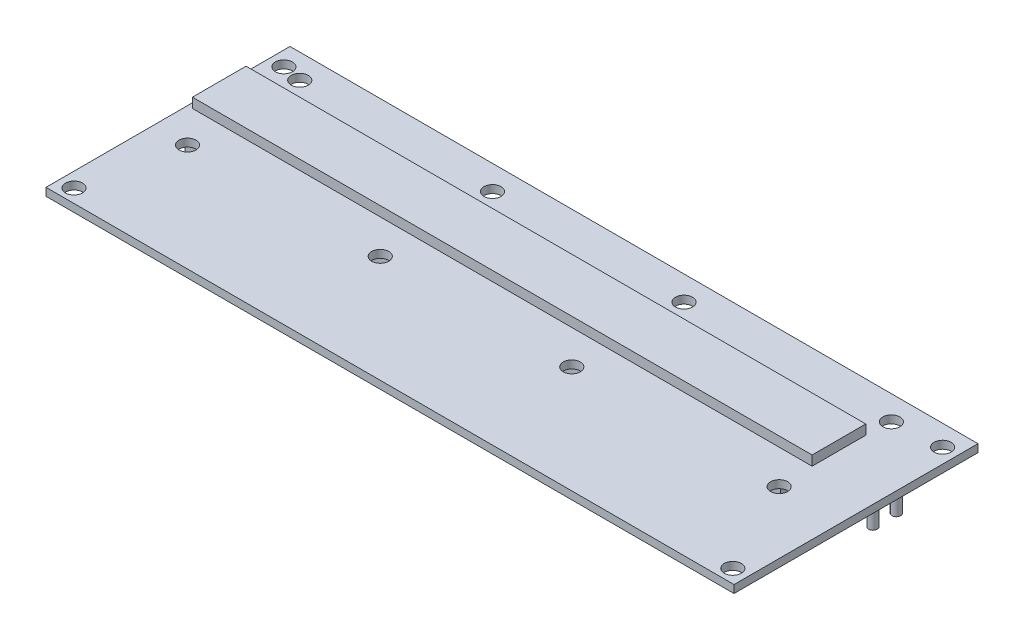
ISO-10303-21;
HEADER;
FILE_DESCRIPTION(('STEP AP214'),'2;1');
FILE_NAME('part.step','',(''),(''),'','','');
FILE_SCHEMA(('AUTOMOTIVE_DESIGN { 1 0 10303 214 1 1 1 1 }'));
ENDSEC;
DATA;
#1=APPLICATION_CONTEXT('core data for automotive mechanical design processes');
#2=APPLICATION_PROTOCOL_DEFINITION('international standard','automotive_design',2000,#1);
#3=PRODUCT_CONTEXT('',#1,'mechanical');
#4=PRODUCT('Part','Part','',(#3));
#5=PRODUCT_RELATED_PRODUCT_CATEGORY('part','',(#4));
#6=PRODUCT_DEFINITION_FORMATION('','',#4);
#7=PRODUCT_DEFINITION_CONTEXT('part definition',#1,'design');
#8=PRODUCT_DEFINITION('design','',#6,#7);
#9=PRODUCT_DEFINITION_SHAPE('','',#8);
#10=(LENGTH_UNIT() NAMED_UNIT(*) SI_UNIT(.MILLI.,.METRE.));
#11=(NAMED_UNIT(*) PLANE_ANGLE_UNIT() SI_UNIT($,.RADIAN.));
#12=(NAMED_UNIT(*) SI_UNIT($,.STERADIAN.) SOLID_ANGLE_UNIT());
#13=UNCERTAINTY_MEASURE_WITH_UNIT(LENGTH_MEASURE(1.E-05),#10,'distance_accuracy_value','');
#14=(GEOMETRIC_REPRESENTATION_CONTEXT(3) GLOBAL_UNCERTAINTY_ASSIGNED_CONTEXT((#13)) GLOBAL_UNIT_ASSIGNED_CONTEXT((#10,
#11,#12)) REPRESENTATION_CONTEXT('',''));
#15=CARTESIAN_POINT('',(0.,0.,0.));
#16=DIRECTION('',(0.,0.,1.));
#17=DIRECTION('',(1.,0.,0.));
#18=AXIS2_PLACEMENT_3D('',#15,#16,#17);
#19=CARTESIAN_POINT('',(-68.5,-11.,-11.5));
#20=DIRECTION('',(0.,0.,1.));
#21=DIRECTION('',(1.,0.,0.));
#22=AXIS2_PLACEMENT_3D('',#19,#20,#21);
#23=PLANE('',#22);
#24=DIRECTION('',(1.,0.,0.));
#25=VECTOR('',#24,1.);
#26=CARTESIAN_POINT('',(-68.5,-11.,-11.5));
#27=LINE('',#26,#25);
#28=CARTESIAN_POINT('',(-52.,-11.,-11.5));
#29=VERTEX_POINT('',#28);
#30=CARTESIAN_POINT('',(53.5,-11.,-11.5));
#31=VERTEX_POINT('',#30);
#32=EDGE_CURVE('E171',#29,#31,#27,.T.);
#33=ORIENTED_EDGE('',*,*,#32,.F.);
#34=DIRECTION('',(0.,-1.,0.));
#35=VECTOR('',#34,1.);
#36=CARTESIAN_POINT('',(-52.,11.9268604418766,-11.5));
#37=LINE('',#36,#35);
#38=CARTESIAN_POINT('',(-52.,0.,-11.5));
#39=VERTEX_POINT('',#38);
#40=EDGE_CURVE('E158',#39,#29,#37,.T.);
#41=ORIENTED_EDGE('',*,*,#40,.F.);
#42=DIRECTION('',(1.,0.,0.));
#43=VECTOR('',#42,1.);
#44=CARTESIAN_POINT('',(-68.5,0.,-11.5));
#45=LINE('',#44,#43);
#46=CARTESIAN_POINT('',(53.5,0.,-11.5));
#47=VERTEX_POINT('',#46);
#48=EDGE_CURVE('E169',#39,#47,#45,.T.);
#49=ORIENTED_EDGE('',*,*,#48,.T.);
#50=DIRECTION('',(0.,1.,0.));
#51=VECTOR('',#50,1.);
#52=CARTESIAN_POINT('',(53.5,-11.,-11.5));
#53=LINE('',#52,#51);
#54=EDGE_CURVE('E200',#31,#47,#53,.T.);
#55=ORIENTED_EDGE('',*,*,#54,.F.);
#56=EDGE_LOOP('',(#33,#41,#49,#55));
#57=FACE_BOUND('',#56,.T.);
#58=ADVANCED_FACE('F40',(#57),#23,.F.);
#59=CARTESIAN_POINT('',(-68.5,-11.,-1.5));
#60=DIRECTION('',(0.,0.,-1.));
#61=DIRECTION('',(-1.,0.,0.));
#62=AXIS2_PLACEMENT_3D('',#59,#60,#61);
#63=PLANE('',#62);
#64=DIRECTION('',(-1.,0.,0.));
#65=VECTOR('',#64,1.);
#66=CARTESIAN_POINT('',(-68.5,0.,-1.5));
#67=LINE('',#66,#65);
#68=CARTESIAN_POINT('',(53.5,0.,-1.5));
#69=VERTEX_POINT('',#68);
#70=CARTESIAN_POINT('',(-52.,0.,-1.5));
#71=VERTEX_POINT('',#70);
#72=EDGE_CURVE('E190',#69,#71,#67,.T.);
#73=ORIENTED_EDGE('',*,*,#72,.T.);
#74=DIRECTION('',(0.,-1.,0.));
#75=VECTOR('',#74,1.);
#76=CARTESIAN_POINT('',(-52.,11.9268604418766,-1.5));
#77=LINE('',#76,#75);
#78=CARTESIAN_POINT('',(-52.,-11.,-1.5));
#79=VERTEX_POINT('',#78);
#80=EDGE_CURVE('E161',#71,#79,#77,.T.);
#81=ORIENTED_EDGE('',*,*,#80,.T.);
#82=DIRECTION('',(-1.,0.,0.));
#83=VECTOR('',#82,1.);
#84=CARTESIAN_POINT('',(-68.5,-11.,-1.5));
#85=LINE('',#84,#83);
#86=CARTESIAN_POINT('',(53.5,-11.,-1.5));
#87=VERTEX_POINT('',#86);
#88=EDGE_CURVE('E197',#87,#79,#85,.T.);
#89=ORIENTED_EDGE('',*,*,#88,.F.);
#90=DIRECTION('',(0.,1.,0.));
#91=VECTOR('',#90,1.);
#92=CARTESIAN_POINT('',(53.5,-11.,-1.5));
#93=LINE('',#92,#91);
#94=EDGE_CURVE('E196',#87,#69,#93,.T.);
#95=ORIENTED_EDGE('',*,*,#94,.T.);
#96=EDGE_LOOP('',(#73,#81,#89,#95));
#97=FACE_BOUND('',#96,.T.);
#98=ADVANCED_FACE('F341',(#97),#63,.F.);
#99=CARTESIAN_POINT('',(0.,-11.,0.));
#100=DIRECTION('',(0.,-1.,0.));
#101=DIRECTION('',(0.,0.,-1.));
#102=AXIS2_PLACEMENT_3D('',#99,#100,#101);
#103=PLANE('',#102);
#104=DIRECTION('',(0.,0.,1.));
#105=VECTOR('',#104,1.);
#106=CARTESIAN_POINT('',(-52.,-11.,-1.5));
#107=LINE('',#106,#105);
#108=EDGE_CURVE('E172',#29,#79,#107,.T.);
#109=ORIENTED_EDGE('',*,*,#108,.F.);
#110=ORIENTED_EDGE('',*,*,#32,.T.);
#111=DIRECTION('',(0.,0.,1.));
#112=VECTOR('',#111,1.);
#113=CARTESIAN_POINT('',(53.5,-11.,-1.5));
#114=LINE('',#113,#112);
#115=EDGE_CURVE('E421',#31,#87,#114,.T.);
#116=ORIENTED_EDGE('',*,*,#115,.T.);
#117=ORIENTED_EDGE('',*,*,#88,.T.);
#118=EDGE_LOOP('',(#109,#110,#116,#117));
#119=FACE_BOUND('',#118,.T.);
#120=ADVANCED_FACE('F347',(#119),#103,.T.);
#121=CARTESIAN_POINT('',(0.,1.6,0.));
#122=DIRECTION('',(0.,1.,0.));
#123=DIRECTION('',(0.,0.,1.));
#124=AXIS2_PLACEMENT_3D('',#121,#122,#123);
#125=PLANE('',#124);
#126=CARTESIAN_POINT('',(15.25,1.6,3.));
#127=DIRECTION('',(0.,1.,0.));
#128=DIRECTION('',(0.,0.,-1.));
#129=AXIS2_PLACEMENT_3D('',#126,#127,#128);
#130=CIRCLE('',#129,1.75);
#131=CARTESIAN_POINT('',(15.25,1.6,1.25));
#132=VERTEX_POINT('',#131);
#133=EDGE_CURVE('E230',#132,#132,#130,.T.);
#134=ORIENTED_EDGE('',*,*,#133,.F.);
#135=EDGE_LOOP('',(#134));
#136=FACE_BOUND('',#135,.T.);
#137=CARTESIAN_POINT('',(-24.,1.6,3.));
#138=DIRECTION('',(0.,1.,0.));
#139=DIRECTION('',(0.,0.,1.));
#140=AXIS2_PLACEMENT_3D('',#137,#138,#139);
#141=CIRCLE('',#140,1.75);
#142=CARTESIAN_POINT('',(-24.,1.6,4.75));
#143=VERTEX_POINT('',#142);
#144=EDGE_CURVE('E233',#143,#143,#141,.T.);
#145=ORIENTED_EDGE('',*,*,#144,.F.);
#146=EDGE_LOOP('',(#145));
#147=FACE_BOUND('',#146,.T.);
#148=CARTESIAN_POINT('',(-63.5,1.6,3.));
#149=DIRECTION('',(0.,1.,0.));
#150=DIRECTION('',(0.,0.,1.));
#151=AXIS2_PLACEMENT_3D('',#148,#149,#150);
#152=CIRCLE('',#151,1.75);
#153=CARTESIAN_POINT('',(-63.5,1.6,4.75));
#154=VERTEX_POINT('',#153);
#155=EDGE_CURVE('E236',#154,#154,#152,.T.);
#156=ORIENTED_EDGE('',*,*,#155,.F.);
#157=EDGE_LOOP('',(#156));
#158=FACE_BOUND('',#157,.T.);
#159=CARTESIAN_POINT('',(-24.,1.6,-20.));
#160=DIRECTION('',(0.,1.,0.));
#161=DIRECTION('',(0.,0.,1.));
#162=AXIS2_PLACEMENT_3D('',#159,#160,#161);
#163=CIRCLE('',#162,1.75);
#164=CARTESIAN_POINT('',(-24.,1.6,-18.25));
#165=VERTEX_POINT('',#164);
#166=EDGE_CURVE('E239',#165,#165,#163,.T.);
#167=ORIENTED_EDGE('',*,*,#166,.F.);
#168=EDGE_LOOP('',(#167));
#169=FACE_BOUND('',#168,.T.);
#170=CARTESIAN_POINT('',(57.75,1.6,-20.));
#171=DIRECTION('',(0.,1.,0.));
#172=DIRECTION('',(0.,0.,-1.));
#173=AXIS2_PLACEMENT_3D('',#170,#171,#172);
#174=CIRCLE('',#173,1.75);
#175=CARTESIAN_POINT('',(57.75,1.6,-21.75));
#176=VERTEX_POINT('',#175);
#177=EDGE_CURVE('E221',#176,#176,#174,.T.);
#178=ORIENTED_EDGE('',*,*,#177,.F.);
#179=EDGE_LOOP('',(#178));
#180=FACE_BOUND('',#179,.T.);
#181=CARTESIAN_POINT('',(15.25,1.6,-20.));
#182=DIRECTION('',(0.,1.,0.));
#183=DIRECTION('',(0.,0.,-1.));
#184=AXIS2_PLACEMENT_3D('',#181,#182,#183);
#185=CIRCLE('',#184,1.75);
#186=CARTESIAN_POINT('',(15.25,1.6,-21.75));
#187=VERTEX_POINT('',#186);
#188=EDGE_CURVE('E226',#187,#187,#185,.T.);
#189=ORIENTED_EDGE('',*,*,#188,.F.);
#190=EDGE_LOOP('',(#189));
#191=FACE_BOUND('',#190,.T.);
#192=CARTESIAN_POINT('',(57.75,1.6,3.));
#193=DIRECTION('',(0.,1.,0.));
#194=DIRECTION('',(0.,0.,-1.));
#195=AXIS2_PLACEMENT_3D('',#192,#193,#194);
#196=CIRCLE('',#195,1.75);
#197=CARTESIAN_POINT('',(57.75,1.6,1.25));
#198=VERTEX_POINT('',#197);
#199=EDGE_CURVE('E227',#198,#198,#196,.T.);
#200=ORIENTED_EDGE('',*,*,#199,.F.);
#201=EDGE_LOOP('',(#200));
#202=FACE_BOUND('',#201,.T.);
#203=CARTESIAN_POINT('',(-63.5,1.6,-20.));
#204=DIRECTION('',(0.,1.,0.));
#205=DIRECTION('',(0.,0.,1.));
#206=AXIS2_PLACEMENT_3D('',#203,#204,#205);
#207=CIRCLE('',#206,1.75);
#208=CARTESIAN_POINT('',(-63.5,1.6,-18.25));
#209=VERTEX_POINT('',#208);
#210=EDGE_CURVE('E242',#209,#209,#207,.T.);
#211=ORIENTED_EDGE('',*,*,#210,.F.);
#212=EDGE_LOOP('',(#211));
#213=FACE_BOUND('',#212,.T.);
#214=CARTESIAN_POINT('',(67.5,1.6,22.25));
#215=DIRECTION('',(0.,1.,0.));
#216=DIRECTION('',(0.,0.,1.));
#217=AXIS2_PLACEMENT_3D('',#214,#215,#216);
#218=CIRCLE('',#217,1.75);
#219=CARTESIAN_POINT('',(67.5,1.6,24.));
#220=VERTEX_POINT('',#219);
#221=EDGE_CURVE('E255',#220,#220,#218,.T.);
#222=ORIENTED_EDGE('',*,*,#221,.F.);
#223=EDGE_LOOP('',(#222));
#224=FACE_BOUND('',#223,.T.);
#225=CARTESIAN_POINT('',(67.5,1.6,-20.75));
#226=DIRECTION('',(0.,1.,0.));
#227=DIRECTION('',(0.,0.,1.));
#228=AXIS2_PLACEMENT_3D('',#225,#226,#227);
#229=CIRCLE('',#228,1.75);
#230=CARTESIAN_POINT('',(67.5,1.6,-19.));
#231=VERTEX_POINT('',#230);
#232=EDGE_CURVE('E252',#231,#231,#229,.T.);
#233=ORIENTED_EDGE('',*,*,#232,.F.);
#234=EDGE_LOOP('',(#233));
#235=FACE_BOUND('',#234,.T.);
#236=CARTESIAN_POINT('',(-67.5,1.6,-20.75));
#237=DIRECTION('',(0.,1.,0.));
#238=DIRECTION('',(0.,0.,1.));
#239=AXIS2_PLACEMENT_3D('',#236,#237,#238);
#240=CIRCLE('',#239,1.75);
#241=CARTESIAN_POINT('',(-67.5,1.6,-19.));
#242=VERTEX_POINT('',#241);
#243=EDGE_CURVE('E248',#242,#242,#240,.T.);
#244=ORIENTED_EDGE('',*,*,#243,.F.);
#245=EDGE_LOOP('',(#244));
#246=FACE_BOUND('',#245,.T.);
#247=CARTESIAN_POINT('',(-67.5,1.6,22.25));
#248=DIRECTION('',(0.,1.,0.));
#249=DIRECTION('',(0.,0.,1.));
#250=AXIS2_PLACEMENT_3D('',#247,#248,#249);
#251=CIRCLE('',#250,1.75);
#252=CARTESIAN_POINT('',(-67.5,1.6,24.));
#253=VERTEX_POINT('',#252);
#254=EDGE_CURVE('E251',#253,#253,#251,.T.);
#255=ORIENTED_EDGE('',*,*,#254,.F.);
#256=EDGE_LOOP('',(#255));
#257=FACE_BOUND('',#256,.T.);
#258=DIRECTION('',(0.,0.,-1.));
#259=VECTOR('',#258,1.);
#260=CARTESIAN_POINT('',(70.5,1.6,-25.));
#261=LINE('',#260,#259);
#262=CARTESIAN_POINT('',(70.5,1.6,25.));
#263=VERTEX_POINT('',#262);
#264=CARTESIAN_POINT('',(70.5,1.6,-25.));
#265=VERTEX_POINT('',#264);
#266=EDGE_CURVE('E261',#263,#265,#261,.T.);
#267=ORIENTED_EDGE('',*,*,#266,.T.);
#268=DIRECTION('',(-1.,0.,0.));
#269=VECTOR('',#268,1.);
#270=CARTESIAN_POINT('',(-70.5,1.6,-25.));
#271=LINE('',#270,#269);
#272=CARTESIAN_POINT('',(-70.5,1.6,-25.));
#273=VERTEX_POINT('',#272);
#274=EDGE_CURVE('E264',#265,#273,#271,.T.);
#275=ORIENTED_EDGE('',*,*,#274,.T.);
#276=DIRECTION('',(0.,0.,1.));
#277=VECTOR('',#276,1.);
#278=CARTESIAN_POINT('',(-70.5,1.6,-25.));
#279=LINE('',#278,#277);
#280=CARTESIAN_POINT('',(-70.5,1.6,25.));
#281=VERTEX_POINT('',#280);
#282=EDGE_CURVE('E267',#273,#281,#279,.T.);
#283=ORIENTED_EDGE('',*,*,#282,.T.);
#284=DIRECTION('',(1.,0.,0.));
#285=VECTOR('',#284,1.);
#286=CARTESIAN_POINT('',(-70.5,1.6,25.));
#287=LINE('',#286,#285);
#288=EDGE_CURVE('E269',#281,#263,#287,.T.);
#289=ORIENTED_EDGE('',*,*,#288,.T.);
#290=EDGE_LOOP('',(#267,#275,#283,#289));
#291=FACE_BOUND('',#290,.T.);
#292=DIRECTION('',(1.,0.,0.));
#293=VECTOR('',#292,1.);
#294=CARTESIAN_POINT('',(-69.5,1.6,-4.));
#295=LINE('',#294,#293);
#296=CARTESIAN_POINT('',(-69.5,1.6,-4.));
#297=VERTEX_POINT('',#296);
#298=CARTESIAN_POINT('',(57.5,1.6,-4.));
#299=VERTEX_POINT('',#298);
#300=EDGE_CURVE('E405',#297,#299,#295,.T.);
#301=ORIENTED_EDGE('',*,*,#300,.F.);
#302=DIRECTION('',(0.,0.,1.));
#303=VECTOR('',#302,1.);
#304=CARTESIAN_POINT('',(-69.5,1.6,-15.));
#305=LINE('',#304,#303);
#306=CARTESIAN_POINT('',(-69.5,1.6,-15.));
#307=VERTEX_POINT('',#306);
#308=EDGE_CURVE('E389',#307,#297,#305,.T.);
#309=ORIENTED_EDGE('',*,*,#308,.F.);
#310=DIRECTION('',(-1.,0.,0.));
#311=VECTOR('',#310,1.);
#312=CARTESIAN_POINT('',(-69.5,1.6,-15.));
#313=LINE('',#312,#311);
#314=CARTESIAN_POINT('',(57.5,1.6,-15.));
#315=VERTEX_POINT('',#314);
#316=EDGE_CURVE('E396',#315,#307,#313,.T.);
#317=ORIENTED_EDGE('',*,*,#316,.F.);
#318=DIRECTION('',(0.,0.,-1.));
#319=VECTOR('',#318,1.);
#320=CARTESIAN_POINT('',(57.5,1.6,-15.));
#321=LINE('',#320,#319);
#322=EDGE_CURVE('E407',#299,#315,#321,.T.);
#323=ORIENTED_EDGE('',*,*,#322,.F.);
#324=EDGE_LOOP('',(#301,#309,#317,#323));
#325=FACE_BOUND('',#324,.T.);
#326=ADVANCED_FACE('F438',(#136,#147,#158,#169,#180,#191,#202,#213,#224,#235,#246,#257,#291,
#325),#125,.T.);
#327=CARTESIAN_POINT('',(0.,0.,0.));
#328=DIRECTION('',(0.,1.,0.));
#329=DIRECTION('',(0.,0.,1.));
#330=AXIS2_PLACEMENT_3D('',#327,#328,#329);
#331=PLANE('',#330);
#332=ORIENTED_EDGE('',*,*,#48,.F.);
#333=DIRECTION('',(0.,0.,1.));
#334=VECTOR('',#333,1.);
#335=CARTESIAN_POINT('',(-52.,0.,-1.5));
#336=LINE('',#335,#334);
#337=EDGE_CURVE('E155',#39,#71,#336,.T.);
#338=ORIENTED_EDGE('',*,*,#337,.T.);
#339=ORIENTED_EDGE('',*,*,#72,.F.);
#340=DIRECTION('',(0.,0.,1.));
#341=VECTOR('',#340,1.);
#342=CARTESIAN_POINT('',(53.5,0.,-1.5));
#343=LINE('',#342,#341);
#344=EDGE_CURVE('E177',#47,#69,#343,.T.);
#345=ORIENTED_EDGE('',*,*,#344,.F.);
#346=EDGE_LOOP('',(#332,#338,#339,#345));
#347=FACE_BOUND('',#346,.T.);
#348=CARTESIAN_POINT('',(67.8751781231778,0.,-6.09309738942425));
#349=DIRECTION('',(0.,1.,0.));
#350=DIRECTION('',(0.,0.,1.));
#351=AXIS2_PLACEMENT_3D('',#348,#349,#350);
#352=CIRCLE('',#351,0.888976414837918);
#353=CARTESIAN_POINT('',(67.8751781231778,0.,-5.20412097458633));
#354=VERTEX_POINT('',#353);
#355=EDGE_CURVE('E379',#354,#354,#352,.T.);
#356=ORIENTED_EDGE('',*,*,#355,.T.);
#357=EDGE_LOOP('',(#356));
#358=FACE_BOUND('',#357,.T.);
#359=CARTESIAN_POINT('',(67.8751781231778,0.,-10.8828976766984));
#360=DIRECTION('',(0.,1.,0.));
#361=DIRECTION('',(0.,0.,1.));
#362=AXIS2_PLACEMENT_3D('',#359,#360,#361);
#363=CIRCLE('',#362,0.888976414837918);
#364=CARTESIAN_POINT('',(67.8751781231778,0.,-9.99392126186049));
#365=VERTEX_POINT('',#364);
#366=EDGE_CURVE('E384',#365,#365,#363,.T.);
#367=ORIENTED_EDGE('',*,*,#366,.T.);
#368=EDGE_LOOP('',(#367));
#369=FACE_BOUND('',#368,.T.);
#370=DIRECTION('',(0.,0.,-1.));
#371=VECTOR('',#370,1.);
#372=CARTESIAN_POINT('',(70.5,0.,-25.));
#373=LINE('',#372,#371);
#374=CARTESIAN_POINT('',(70.5,0.,25.));
#375=VERTEX_POINT('',#374);
#376=CARTESIAN_POINT('',(70.5,0.,-25.));
#377=VERTEX_POINT('',#376);
#378=EDGE_CURVE('E272',#375,#377,#373,.T.);
#379=ORIENTED_EDGE('',*,*,#378,.F.);
#380=DIRECTION('',(1.,0.,0.));
#381=VECTOR('',#380,1.);
#382=CARTESIAN_POINT('',(-70.5,0.,25.));
#383=LINE('',#382,#381);
#384=CARTESIAN_POINT('',(-70.5,0.,25.));
#385=VERTEX_POINT('',#384);
#386=EDGE_CURVE('E265',#385,#375,#383,.T.);
#387=ORIENTED_EDGE('',*,*,#386,.F.);
#388=DIRECTION('',(0.,0.,1.));
#389=VECTOR('',#388,1.);
#390=CARTESIAN_POINT('',(-70.5,0.,-25.));
#391=LINE('',#390,#389);
#392=CARTESIAN_POINT('',(-70.5,0.,-25.));
#393=VERTEX_POINT('',#392);
#394=EDGE_CURVE('E278',#393,#385,#391,.T.);
#395=ORIENTED_EDGE('',*,*,#394,.F.);
#396=DIRECTION('',(-1.,0.,0.));
#397=VECTOR('',#396,1.);
#398=CARTESIAN_POINT('',(-70.5,0.,-25.));
#399=LINE('',#398,#397);
#400=EDGE_CURVE('E275',#377,#393,#399,.T.);
#401=ORIENTED_EDGE('',*,*,#400,.F.);
#402=EDGE_LOOP('',(#379,#387,#395,#401));
#403=FACE_BOUND('',#402,.T.);
#404=CARTESIAN_POINT('',(-67.5,0.,22.25));
#405=DIRECTION('',(0.,1.,0.));
#406=DIRECTION('',(0.,0.,1.));
#407=AXIS2_PLACEMENT_3D('',#404,#405,#406);
#408=CIRCLE('',#407,1.75);
#409=CARTESIAN_POINT('',(-67.5,0.,24.));
#410=VERTEX_POINT('',#409);
#411=EDGE_CURVE('E260',#410,#410,#408,.T.);
#412=ORIENTED_EDGE('',*,*,#411,.T.);
#413=EDGE_LOOP('',(#412));
#414=FACE_BOUND('',#413,.T.);
#415=CARTESIAN_POINT('',(-67.5,0.,-20.75));
#416=DIRECTION('',(0.,1.,0.));
#417=DIRECTION('',(0.,0.,1.));
#418=AXIS2_PLACEMENT_3D('',#415,#416,#417);
#419=CIRCLE('',#418,1.75);
#420=CARTESIAN_POINT('',(-67.5,0.,-19.));
#421=VERTEX_POINT('',#420);
#422=EDGE_CURVE('E290',#421,#421,#419,.T.);
#423=ORIENTED_EDGE('',*,*,#422,.T.);
#424=EDGE_LOOP('',(#423));
#425=FACE_BOUND('',#424,.T.);
#426=CARTESIAN_POINT('',(67.5,0.,-20.75));
#427=DIRECTION('',(0.,1.,0.));
#428=DIRECTION('',(0.,0.,1.));
#429=AXIS2_PLACEMENT_3D('',#426,#427,#428);
#430=CIRCLE('',#429,1.75);
#431=CARTESIAN_POINT('',(67.5,0.,-19.));
#432=VERTEX_POINT('',#431);
#433=EDGE_CURVE('E293',#432,#432,#430,.T.);
#434=ORIENTED_EDGE('',*,*,#433,.T.);
#435=EDGE_LOOP('',(#434));
#436=FACE_BOUND('',#435,.T.);
#437=CARTESIAN_POINT('',(67.5,0.,22.25));
#438=DIRECTION('',(0.,1.,0.));
#439=DIRECTION('',(0.,0.,1.));
#440=AXIS2_PLACEMENT_3D('',#437,#438,#439);
#441=CIRCLE('',#440,1.75);
#442=CARTESIAN_POINT('',(67.5,0.,24.));
#443=VERTEX_POINT('',#442);
#444=EDGE_CURVE('E276',#443,#443,#441,.T.);
#445=ORIENTED_EDGE('',*,*,#444,.T.);
#446=EDGE_LOOP('',(#445));
#447=FACE_BOUND('',#446,.T.);
#448=CARTESIAN_POINT('',(-63.5,0.,-20.));
#449=DIRECTION('',(0.,1.,0.));
#450=DIRECTION('',(0.,0.,1.));
#451=AXIS2_PLACEMENT_3D('',#448,#449,#450);
#452=CIRCLE('',#451,1.75);
#453=CARTESIAN_POINT('',(-63.5,0.,-18.25));
#454=VERTEX_POINT('',#453);
#455=EDGE_CURVE('E247',#454,#454,#452,.T.);
#456=ORIENTED_EDGE('',*,*,#455,.T.);
#457=EDGE_LOOP('',(#456));
#458=FACE_BOUND('',#457,.T.);
#459=CARTESIAN_POINT('',(57.75,0.,3.));
#460=DIRECTION('',(0.,1.,0.));
#461=DIRECTION('',(0.,0.,1.));
#462=AXIS2_PLACEMENT_3D('',#459,#460,#461);
#463=CIRCLE('',#462,1.75);
#464=CARTESIAN_POINT('',(57.75,0.,4.75));
#465=VERTEX_POINT('',#464);
#466=EDGE_CURVE('E300',#465,#465,#463,.T.);
#467=ORIENTED_EDGE('',*,*,#466,.T.);
#468=EDGE_LOOP('',(#467));
#469=FACE_BOUND('',#468,.T.);
#470=CARTESIAN_POINT('',(15.25,0.,-20.));
#471=DIRECTION('',(0.,1.,0.));
#472=DIRECTION('',(0.,0.,1.));
#473=AXIS2_PLACEMENT_3D('',#470,#471,#472);
#474=CIRCLE('',#473,1.75);
#475=CARTESIAN_POINT('',(15.25,0.,-18.25));
#476=VERTEX_POINT('',#475);
#477=EDGE_CURVE('E303',#476,#476,#474,.T.);
#478=ORIENTED_EDGE('',*,*,#477,.T.);
#479=EDGE_LOOP('',(#478));
#480=FACE_BOUND('',#479,.T.);
#481=CARTESIAN_POINT('',(57.75,0.,-20.));
#482=DIRECTION('',(0.,1.,0.));
#483=DIRECTION('',(0.,0.,1.));
#484=AXIS2_PLACEMENT_3D('',#481,#482,#483);
#485=CIRCLE('',#484,1.75);
#486=CARTESIAN_POINT('',(57.75,0.,-18.25));
#487=VERTEX_POINT('',#486);
#488=EDGE_CURVE('E306',#487,#487,#485,.T.);
#489=ORIENTED_EDGE('',*,*,#488,.T.);
#490=EDGE_LOOP('',(#489));
#491=FACE_BOUND('',#490,.T.);
#492=CARTESIAN_POINT('',(-24.,0.,-20.));
#493=DIRECTION('',(0.,1.,0.));
#494=DIRECTION('',(0.,0.,1.));
#495=AXIS2_PLACEMENT_3D('',#492,#493,#494);
#496=CIRCLE('',#495,1.75);
#497=CARTESIAN_POINT('',(-24.,0.,-18.25));
#498=VERTEX_POINT('',#497);
#499=EDGE_CURVE('E309',#498,#498,#496,.T.);
#500=ORIENTED_EDGE('',*,*,#499,.T.);
#501=EDGE_LOOP('',(#500));
#502=FACE_BOUND('',#501,.T.);
#503=CARTESIAN_POINT('',(-63.5,0.,3.));
#504=DIRECTION('',(0.,1.,0.));
#505=DIRECTION('',(0.,0.,1.));
#506=AXIS2_PLACEMENT_3D('',#503,#504,#505);
#507=CIRCLE('',#506,1.75);
#508=CARTESIAN_POINT('',(-63.5,0.,4.75));
#509=VERTEX_POINT('',#508);
#510=EDGE_CURVE('E312',#509,#509,#507,.T.);
#511=ORIENTED_EDGE('',*,*,#510,.T.);
#512=EDGE_LOOP('',(#511));
#513=FACE_BOUND('',#512,.T.);
#514=CARTESIAN_POINT('',(-24.,0.,3.));
#515=DIRECTION('',(0.,1.,0.));
#516=DIRECTION('',(0.,0.,1.));
#517=AXIS2_PLACEMENT_3D('',#514,#515,#516);
#518=CIRCLE('',#517,1.75);
#519=CARTESIAN_POINT('',(-24.,0.,4.75));
#520=VERTEX_POINT('',#519);
#521=EDGE_CURVE('E314',#520,#520,#518,.T.);
#522=ORIENTED_EDGE('',*,*,#521,.T.);
#523=EDGE_LOOP('',(#522));
#524=FACE_BOUND('',#523,.T.);
#525=CARTESIAN_POINT('',(15.25,0.,3.));
#526=DIRECTION('',(0.,1.,0.));
#527=DIRECTION('',(0.,0.,1.));
#528=AXIS2_PLACEMENT_3D('',#525,#526,#527);
#529=CIRCLE('',#528,1.75);
#530=CARTESIAN_POINT('',(15.25,0.,4.75));
#531=VERTEX_POINT('',#530);
#532=EDGE_CURVE('E44',#531,#531,#529,.T.);
#533=ORIENTED_EDGE('',*,*,#532,.T.);
#534=EDGE_LOOP('',(#533));
#535=FACE_BOUND('',#534,.T.);
#536=CARTESIAN_POINT('',(-47.0788982037544,0.,-20.));
#537=DIRECTION('',(0.,1.,0.));
#538=DIRECTION('',(0.,0.,1.));
#539=AXIS2_PLACEMENT_3D('',#536,#537,#538);
#540=CIRCLE('',#539,1.23413200270969);
#541=CARTESIAN_POINT('',(-47.0788982037544,0.,-18.7658679972903));
#542=VERTEX_POINT('',#541);
#543=EDGE_CURVE('E215',#542,#542,#540,.T.);
#544=ORIENTED_EDGE('',*,*,#543,.T.);
#545=EDGE_LOOP('',(#544));
#546=FACE_BOUND('',#545,.T.);
#547=CARTESIAN_POINT('',(-43.75,0.,-20.));
#548=DIRECTION('',(0.,1.,0.));
#549=DIRECTION('',(0.,0.,1.));
#550=AXIS2_PLACEMENT_3D('',#547,#548,#549);
#551=CIRCLE('',#550,1.23413200270969);
#552=CARTESIAN_POINT('',(-43.75,0.,-18.7658679972903));
#553=VERTEX_POINT('',#552);
#554=EDGE_CURVE('E212',#553,#553,#551,.T.);
#555=ORIENTED_EDGE('',*,*,#554,.T.);
#556=EDGE_LOOP('',(#555));
#557=FACE_BOUND('',#556,.T.);
#558=CARTESIAN_POINT('',(-40.4211017962455,0.,-20.));
#559=DIRECTION('',(0.,1.,0.));
#560=DIRECTION('',(0.,0.,1.));
#561=AXIS2_PLACEMENT_3D('',#558,#559,#560);
#562=CIRCLE('',#561,1.23413200270969);
#563=CARTESIAN_POINT('',(-40.4211017962455,0.,-18.7658679972903));
#564=VERTEX_POINT('',#563);
#565=EDGE_CURVE('E206',#564,#564,#562,.T.);
#566=ORIENTED_EDGE('',*,*,#565,.T.);
#567=EDGE_LOOP('',(#566));
#568=FACE_BOUND('',#567,.T.);
#569=DIRECTION('',(0.,0.,-1.));
#570=VECTOR('',#569,1.);
#571=CARTESIAN_POINT('',(-68.5,0.,-1.5));
#572=LINE('',#571,#570);
#573=CARTESIAN_POINT('',(-68.5,0.,-1.5));
#574=VERTEX_POINT('',#573);
#575=CARTESIAN_POINT('',(-68.5,0.,-11.5));
#576=VERTEX_POINT('',#575);
#577=EDGE_CURVE('E180',#574,#576,#572,.T.);
#578=ORIENTED_EDGE('',*,*,#577,.F.);
#579=CARTESIAN_POINT('',(-58.5,0.,-1.5));
#580=VERTEX_POINT('',#579);
#581=EDGE_CURVE('E189',#580,#574,#67,.T.);
#582=ORIENTED_EDGE('',*,*,#581,.F.);
#583=DIRECTION('',(0.,0.,-1.));
#584=VECTOR('',#583,1.);
#585=CARTESIAN_POINT('',(-58.5,0.,-1.5));
#586=LINE('',#585,#584);
#587=CARTESIAN_POINT('',(-58.5,0.,-11.5));
#588=VERTEX_POINT('',#587);
#589=EDGE_CURVE('E372',#580,#588,#586,.T.);
#590=ORIENTED_EDGE('',*,*,#589,.T.);
#591=EDGE_CURVE('E179',#576,#588,#45,.T.);
#592=ORIENTED_EDGE('',*,*,#591,.F.);
#593=EDGE_LOOP('',(#578,#582,#590,#592));
#594=FACE_BOUND('',#593,.T.);
#595=ADVANCED_FACE('F174',(#347,#358,#369,#403,#414,#425,#436,#447,#458,#469,#480,#491,#502,
#513,#524,#535,#546,#557,#568,#594),#331,.F.);
#596=CARTESIAN_POINT('',(70.5,1.6,-25.));
#597=DIRECTION('',(-1.,0.,0.));
#598=DIRECTION('',(0.,0.,1.));
#599=AXIS2_PLACEMENT_3D('',#596,#597,#598);
#600=PLANE('',#599);
#601=ORIENTED_EDGE('',*,*,#378,.T.);
#602=DIRECTION('',(0.,-1.,0.));
#603=VECTOR('',#602,1.);
#604=CARTESIAN_POINT('',(70.5,1.6,-25.));
#605=LINE('',#604,#603);
#606=EDGE_CURVE('E11',#265,#377,#605,.T.);
#607=ORIENTED_EDGE('',*,*,#606,.F.);
#608=ORIENTED_EDGE('',*,*,#266,.F.);
#609=DIRECTION('',(0.,-1.,0.));
#610=VECTOR('',#609,1.);
#611=CARTESIAN_POINT('',(70.5,1.6,25.));
#612=LINE('',#611,#610);
#613=EDGE_CURVE('E271',#263,#375,#612,.T.);
#614=ORIENTED_EDGE('',*,*,#613,.T.);
#615=EDGE_LOOP('',(#601,#607,#608,#614));
#616=FACE_BOUND('',#615,.T.);
#617=ADVANCED_FACE('F42',(#616),#600,.F.);
#618=CARTESIAN_POINT('',(-70.5,1.6,-25.));
#619=DIRECTION('',(0.,0.,1.));
#620=DIRECTION('',(1.,0.,0.));
#621=AXIS2_PLACEMENT_3D('',#618,#619,#620);
#622=PLANE('',#621);
#623=ORIENTED_EDGE('',*,*,#400,.T.);
#624=DIRECTION('',(0.,-1.,0.));
#625=VECTOR('',#624,1.);
#626=CARTESIAN_POINT('',(-70.5,1.6,-25.));
#627=LINE('',#626,#625);
#628=EDGE_CURVE('E49',#273,#393,#627,.T.);
#629=ORIENTED_EDGE('',*,*,#628,.F.);
#630=ORIENTED_EDGE('',*,*,#274,.F.);
#631=ORIENTED_EDGE('',*,*,#606,.T.);
#632=EDGE_LOOP('',(#623,#629,#630,#631));
#633=FACE_BOUND('',#632,.T.);
#634=ADVANCED_FACE('F823',(#633),#622,.F.);
#635=CARTESIAN_POINT('',(-70.5,1.6,-25.));
#636=DIRECTION('',(1.,0.,0.));
#637=DIRECTION('',(0.,0.,-1.));
#638=AXIS2_PLACEMENT_3D('',#635,#636,#637);
#639=PLANE('',#638);
#640=ORIENTED_EDGE('',*,*,#394,.T.);
#641=DIRECTION('',(0.,-1.,0.));
#642=VECTOR('',#641,1.);
#643=CARTESIAN_POINT('',(-70.5,1.6,25.));
#644=LINE('',#643,#642);
#645=EDGE_CURVE('E283',#281,#385,#644,.T.);
#646=ORIENTED_EDGE('',*,*,#645,.F.);
#647=ORIENTED_EDGE('',*,*,#282,.F.);
#648=ORIENTED_EDGE('',*,*,#628,.T.);
#649=EDGE_LOOP('',(#640,#646,#647,#648));
#650=FACE_BOUND('',#649,.T.);
#651=ADVANCED_FACE('F812',(#650),#639,.F.);
#652=CARTESIAN_POINT('',(-70.5,1.6,25.));
#653=DIRECTION('',(0.,0.,-1.));
#654=DIRECTION('',(-1.,0.,0.));
#655=AXIS2_PLACEMENT_3D('',#652,#653,#654);
#656=PLANE('',#655);
#657=ORIENTED_EDGE('',*,*,#386,.T.);
#658=ORIENTED_EDGE('',*,*,#613,.F.);
#659=ORIENTED_EDGE('',*,*,#288,.F.);
#660=ORIENTED_EDGE('',*,*,#645,.T.);
#661=EDGE_LOOP('',(#657,#658,#659,#660));
#662=FACE_BOUND('',#661,.T.);
#663=ADVANCED_FACE('F801',(#662),#656,.F.);
#664=CARTESIAN_POINT('',(-67.5,-8.4,22.25));
#665=DIRECTION('',(0.,1.,0.));
#666=DIRECTION('',(0.,0.,1.));
#667=AXIS2_PLACEMENT_3D('',#664,#665,#666);
#668=CYLINDRICAL_SURFACE('',#667,1.75);
#669=ORIENTED_EDGE('',*,*,#254,.T.);
#670=EDGE_LOOP('',(#669));
#671=FACE_BOUND('',#670,.T.);
#672=ORIENTED_EDGE('',*,*,#411,.F.);
#673=EDGE_LOOP('',(#672));
#674=FACE_BOUND('',#673,.T.);
#675=ADVANCED_FACE('F790',(#671,#674),#668,.F.);
#676=CARTESIAN_POINT('',(-67.5,-8.4,-20.75));
#677=DIRECTION('',(0.,1.,0.));
#678=DIRECTION('',(0.,0.,1.));
#679=AXIS2_PLACEMENT_3D('',#676,#677,#678);
#680=CYLINDRICAL_SURFACE('',#679,1.75);
#681=ORIENTED_EDGE('',*,*,#243,.T.);
#682=EDGE_LOOP('',(#681));
#683=FACE_BOUND('',#682,.T.);
#684=ORIENTED_EDGE('',*,*,#422,.F.);
#685=EDGE_LOOP('',(#684));
#686=FACE_BOUND('',#685,.T.);
#687=ADVANCED_FACE('F779',(#683,#686),#680,.F.);
#688=CARTESIAN_POINT('',(67.5,-8.4,-20.75));
#689=DIRECTION('',(0.,1.,0.));
#690=DIRECTION('',(0.,0.,1.));
#691=AXIS2_PLACEMENT_3D('',#688,#689,#690);
#692=CYLINDRICAL_SURFACE('',#691,1.75);
#693=ORIENTED_EDGE('',*,*,#232,.T.);
#694=EDGE_LOOP('',(#693));
#695=FACE_BOUND('',#694,.T.);
#696=ORIENTED_EDGE('',*,*,#433,.F.);
#697=EDGE_LOOP('',(#696));
#698=FACE_BOUND('',#697,.T.);
#699=ADVANCED_FACE('F768',(#695,#698),#692,.F.);
#700=CARTESIAN_POINT('',(67.5,-8.4,22.25));
#701=DIRECTION('',(0.,1.,0.));
#702=DIRECTION('',(0.,0.,1.));
#703=AXIS2_PLACEMENT_3D('',#700,#701,#702);
#704=CYLINDRICAL_SURFACE('',#703,1.75);
#705=ORIENTED_EDGE('',*,*,#221,.T.);
#706=EDGE_LOOP('',(#705));
#707=FACE_BOUND('',#706,.T.);
#708=ORIENTED_EDGE('',*,*,#444,.F.);
#709=EDGE_LOOP('',(#708));
#710=FACE_BOUND('',#709,.T.);
#711=ADVANCED_FACE('F757',(#707,#710),#704,.F.);
#712=CARTESIAN_POINT('',(-63.5,-8.4,-20.));
#713=DIRECTION('',(0.,1.,0.));
#714=DIRECTION('',(0.,0.,1.));
#715=AXIS2_PLACEMENT_3D('',#712,#713,#714);
#716=CYLINDRICAL_SURFACE('',#715,1.75);
#717=ORIENTED_EDGE('',*,*,#210,.T.);
#718=EDGE_LOOP('',(#717));
#719=FACE_BOUND('',#718,.T.);
#720=ORIENTED_EDGE('',*,*,#455,.F.);
#721=EDGE_LOOP('',(#720));
#722=FACE_BOUND('',#721,.T.);
#723=ADVANCED_FACE('F746',(#719,#722),#716,.F.);
#724=CARTESIAN_POINT('',(57.75,-8.4,3.));
#725=DIRECTION('',(0.,1.,0.));
#726=DIRECTION('',(0.,0.,1.));
#727=AXIS2_PLACEMENT_3D('',#724,#725,#726);
#728=CYLINDRICAL_SURFACE('',#727,1.75);
#729=ORIENTED_EDGE('',*,*,#199,.T.);
#730=EDGE_LOOP('',(#729));
#731=FACE_BOUND('',#730,.T.);
#732=ORIENTED_EDGE('',*,*,#466,.F.);
#733=EDGE_LOOP('',(#732));
#734=FACE_BOUND('',#733,.T.);
#735=ADVANCED_FACE('F735',(#731,#734),#728,.F.);
#736=CARTESIAN_POINT('',(15.25,-8.4,-20.));
#737=DIRECTION('',(0.,1.,0.));
#738=DIRECTION('',(0.,0.,1.));
#739=AXIS2_PLACEMENT_3D('',#736,#737,#738);
#740=CYLINDRICAL_SURFACE('',#739,1.75);
#741=ORIENTED_EDGE('',*,*,#188,.T.);
#742=EDGE_LOOP('',(#741));
#743=FACE_BOUND('',#742,.T.);
#744=ORIENTED_EDGE('',*,*,#477,.F.);
#745=EDGE_LOOP('',(#744));
#746=FACE_BOUND('',#745,.T.);
#747=ADVANCED_FACE('F724',(#743,#746),#740,.F.);
#748=CARTESIAN_POINT('',(57.75,-8.4,-20.));
#749=DIRECTION('',(0.,1.,0.));
#750=DIRECTION('',(0.,0.,1.));
#751=AXIS2_PLACEMENT_3D('',#748,#749,#750);
#752=CYLINDRICAL_SURFACE('',#751,1.75);
#753=ORIENTED_EDGE('',*,*,#177,.T.);
#754=EDGE_LOOP('',(#753));
#755=FACE_BOUND('',#754,.T.);
#756=ORIENTED_EDGE('',*,*,#488,.F.);
#757=EDGE_LOOP('',(#756));
#758=FACE_BOUND('',#757,.T.);
#759=ADVANCED_FACE('F714',(#755,#758),#752,.F.);
#760=CARTESIAN_POINT('',(-24.,-8.4,-20.));
#761=DIRECTION('',(0.,1.,0.));
#762=DIRECTION('',(0.,0.,1.));
#763=AXIS2_PLACEMENT_3D('',#760,#761,#762);
#764=CYLINDRICAL_SURFACE('',#763,1.75);
#765=ORIENTED_EDGE('',*,*,#166,.T.);
#766=EDGE_LOOP('',(#765));
#767=FACE_BOUND('',#766,.T.);
#768=ORIENTED_EDGE('',*,*,#499,.F.);
#769=EDGE_LOOP('',(#768));
#770=FACE_BOUND('',#769,.T.);
#771=ADVANCED_FACE('F703',(#767,#770),#764,.F.);
#772=CARTESIAN_POINT('',(-63.5,-8.4,3.));
#773=DIRECTION('',(0.,1.,0.));
#774=DIRECTION('',(0.,0.,1.));
#775=AXIS2_PLACEMENT_3D('',#772,#773,#774);
#776=CYLINDRICAL_SURFACE('',#775,1.75);
#777=ORIENTED_EDGE('',*,*,#155,.T.);
#778=EDGE_LOOP('',(#777));
#779=FACE_BOUND('',#778,.T.);
#780=ORIENTED_EDGE('',*,*,#510,.F.);
#781=EDGE_LOOP('',(#780));
#782=FACE_BOUND('',#781,.T.);
#783=ADVANCED_FACE('F336',(#779,#782),#776,.F.);
#784=CARTESIAN_POINT('',(-24.,-8.4,3.));
#785=DIRECTION('',(0.,1.,0.));
#786=DIRECTION('',(0.,0.,1.));
#787=AXIS2_PLACEMENT_3D('',#784,#785,#786);
#788=CYLINDRICAL_SURFACE('',#787,1.75);
#789=ORIENTED_EDGE('',*,*,#144,.T.);
#790=EDGE_LOOP('',(#789));
#791=FACE_BOUND('',#790,.T.);
#792=ORIENTED_EDGE('',*,*,#521,.F.);
#793=EDGE_LOOP('',(#792));
#794=FACE_BOUND('',#793,.T.);
#795=ADVANCED_FACE('F326',(#791,#794),#788,.F.);
#796=CARTESIAN_POINT('',(15.25,-8.4,3.));
#797=DIRECTION('',(0.,1.,0.));
#798=DIRECTION('',(0.,0.,1.));
#799=AXIS2_PLACEMENT_3D('',#796,#797,#798);
#800=CYLINDRICAL_SURFACE('',#799,1.75);
#801=ORIENTED_EDGE('',*,*,#133,.T.);
#802=EDGE_LOOP('',(#801));
#803=FACE_BOUND('',#802,.T.);
#804=ORIENTED_EDGE('',*,*,#532,.F.);
#805=EDGE_LOOP('',(#804));
#806=FACE_BOUND('',#805,.T.);
#807=ADVANCED_FACE('F323',(#803,#806),#800,.F.);
#808=CARTESIAN_POINT('',(-47.0788982037544,-5.,-20.));
#809=DIRECTION('',(0.,1.,0.));
#810=DIRECTION('',(0.,0.,1.));
#811=AXIS2_PLACEMENT_3D('',#808,#809,#810);
#812=CYLINDRICAL_SURFACE('',#811,1.23413200270969);
#813=CARTESIAN_POINT('',(-47.0788982037544,-5.,-20.));
#814=DIRECTION('',(0.,1.,0.));
#815=DIRECTION('',(0.,0.,1.));
#816=AXIS2_PLACEMENT_3D('',#813,#814,#815);
#817=CIRCLE('',#816,1.23413200270969);
#818=CARTESIAN_POINT('',(-47.0788982037544,-5.,-18.7658679972903));
#819=VERTEX_POINT('',#818);
#820=EDGE_CURVE('E218',#819,#819,#817,.T.);
#821=ORIENTED_EDGE('',*,*,#820,.T.);
#822=EDGE_LOOP('',(#821));
#823=FACE_BOUND('',#822,.T.);
#824=ORIENTED_EDGE('',*,*,#543,.F.);
#825=EDGE_LOOP('',(#824));
#826=FACE_BOUND('',#825,.T.);
#827=ADVANCED_FACE('F325',(#823,#826),#812,.T.);
#828=CARTESIAN_POINT('',(-47.0788982037544,-5.,-20.));
#829=DIRECTION('',(0.,1.,0.));
#830=DIRECTION('',(0.,0.,1.));
#831=AXIS2_PLACEMENT_3D('',#828,#829,#830);
#832=PLANE('',#831);
#833=ORIENTED_EDGE('',*,*,#820,.F.);
#834=EDGE_LOOP('',(#833));
#835=FACE_BOUND('',#834,.T.);
#836=ADVANCED_FACE('F333',(#835),#832,.F.);
#837=CARTESIAN_POINT('',(-43.75,-5.,-20.));
#838=DIRECTION('',(0.,1.,0.));
#839=DIRECTION('',(0.,0.,1.));
#840=AXIS2_PLACEMENT_3D('',#837,#838,#839);
#841=CYLINDRICAL_SURFACE('',#840,1.23413200270969);
#842=CARTESIAN_POINT('',(-43.75,-5.,-20.));
#843=DIRECTION('',(0.,1.,0.));
#844=DIRECTION('',(0.,0.,1.));
#845=AXIS2_PLACEMENT_3D('',#842,#843,#844);
#846=CIRCLE('',#845,1.23413200270969);
#847=CARTESIAN_POINT('',(-43.75,-5.,-18.7658679972903));
#848=VERTEX_POINT('',#847);
#849=EDGE_CURVE('E209',#848,#848,#846,.T.);
#850=ORIENTED_EDGE('',*,*,#849,.T.);
#851=EDGE_LOOP('',(#850));
#852=FACE_BOUND('',#851,.T.);
#853=ORIENTED_EDGE('',*,*,#554,.F.);
#854=EDGE_LOOP('',(#853));
#855=FACE_BOUND('',#854,.T.);
#856=ADVANCED_FACE('F649',(#852,#855),#841,.T.);
#857=CARTESIAN_POINT('',(-43.75,-5.,-20.));
#858=DIRECTION('',(0.,1.,0.));
#859=DIRECTION('',(0.,0.,1.));
#860=AXIS2_PLACEMENT_3D('',#857,#858,#859);
#861=PLANE('',#860);
#862=ORIENTED_EDGE('',*,*,#849,.F.);
#863=EDGE_LOOP('',(#862));
#864=FACE_BOUND('',#863,.T.);
#865=ADVANCED_FACE('F637',(#864),#861,.F.);
#866=CARTESIAN_POINT('',(-40.4211017962455,-5.,-20.));
#867=DIRECTION('',(0.,1.,0.));
#868=DIRECTION('',(0.,0.,1.));
#869=AXIS2_PLACEMENT_3D('',#866,#867,#868);
#870=CYLINDRICAL_SURFACE('',#869,1.23413200270969);
#871=CARTESIAN_POINT('',(-40.4211017962455,-5.,-20.));
#872=DIRECTION('',(0.,1.,0.));
#873=DIRECTION('',(0.,0.,1.));
#874=AXIS2_PLACEMENT_3D('',#871,#872,#873);
#875=CIRCLE('',#874,1.23413200270969);
#876=CARTESIAN_POINT('',(-40.4211017962455,-5.,-18.7658679972903));
#877=VERTEX_POINT('',#876);
#878=EDGE_CURVE('E205',#877,#877,#875,.T.);
#879=ORIENTED_EDGE('',*,*,#878,.T.);
#880=EDGE_LOOP('',(#879));
#881=FACE_BOUND('',#880,.T.);
#882=ORIENTED_EDGE('',*,*,#565,.F.);
#883=EDGE_LOOP('',(#882));
#884=FACE_BOUND('',#883,.T.);
#885=ADVANCED_FACE('F625',(#881,#884),#870,.T.);
#886=CARTESIAN_POINT('',(-40.4211017962455,-5.,-20.));
#887=DIRECTION('',(0.,1.,0.));
#888=DIRECTION('',(0.,0.,1.));
#889=AXIS2_PLACEMENT_3D('',#886,#887,#888);
#890=PLANE('',#889);
#891=ORIENTED_EDGE('',*,*,#878,.F.);
#892=EDGE_LOOP('',(#891));
#893=FACE_BOUND('',#892,.T.);
#894=ADVANCED_FACE('F362',(#893),#890,.F.);
#895=CARTESIAN_POINT('',(-68.5,-11.,-1.5));
#896=DIRECTION('',(1.,0.,0.));
#897=DIRECTION('',(0.,0.,-1.));
#898=AXIS2_PLACEMENT_3D('',#895,#896,#897);
#899=PLANE('',#898);
#900=ORIENTED_EDGE('',*,*,#577,.T.);
#901=DIRECTION('',(0.,1.,0.));
#902=VECTOR('',#901,1.);
#903=CARTESIAN_POINT('',(-68.5,-11.,-11.5));
#904=LINE('',#903,#902);
#905=CARTESIAN_POINT('',(-68.5,-11.,-11.5));
#906=VERTEX_POINT('',#905);
#907=EDGE_CURVE('E202',#906,#576,#904,.T.);
#908=ORIENTED_EDGE('',*,*,#907,.F.);
#909=DIRECTION('',(0.,0.,-1.));
#910=VECTOR('',#909,1.);
#911=CARTESIAN_POINT('',(-68.5,-11.,-1.5));
#912=LINE('',#911,#910);
#913=CARTESIAN_POINT('',(-68.5,-11.,-1.5));
#914=VERTEX_POINT('',#913);
#915=EDGE_CURVE('E192',#914,#906,#912,.T.);
#916=ORIENTED_EDGE('',*,*,#915,.F.);
#917=DIRECTION('',(0.,1.,0.));
#918=VECTOR('',#917,1.);
#919=CARTESIAN_POINT('',(-68.5,-11.,-1.5));
#920=LINE('',#919,#918);
#921=EDGE_CURVE('E193',#914,#574,#920,.T.);
#922=ORIENTED_EDGE('',*,*,#921,.T.);
#923=EDGE_LOOP('',(#900,#908,#916,#922));
#924=FACE_BOUND('',#923,.T.);
#925=ADVANCED_FACE('F355',(#924),#899,.F.);
#926=ORIENTED_EDGE('',*,*,#591,.T.);
#927=DIRECTION('',(0.,-1.,0.));
#928=VECTOR('',#927,1.);
#929=CARTESIAN_POINT('',(-58.5,11.9268604418766,-11.5));
#930=LINE('',#929,#928);
#931=CARTESIAN_POINT('',(-58.5,-11.,-11.5));
#932=VERTEX_POINT('',#931);
#933=EDGE_CURVE('E366',#588,#932,#930,.T.);
#934=ORIENTED_EDGE('',*,*,#933,.T.);
#935=EDGE_CURVE('E419',#906,#932,#27,.T.);
#936=ORIENTED_EDGE('',*,*,#935,.F.);
#937=ORIENTED_EDGE('',*,*,#907,.T.);
#938=EDGE_LOOP('',(#926,#934,#936,#937));
#939=FACE_BOUND('',#938,.T.);
#940=ADVANCED_FACE('F343',(#939),#23,.F.);
#941=CARTESIAN_POINT('',(53.5,-11.,-1.5));
#942=DIRECTION('',(-1.,0.,0.));
#943=DIRECTION('',(0.,0.,1.));
#944=AXIS2_PLACEMENT_3D('',#941,#942,#943);
#945=PLANE('',#944);
#946=ORIENTED_EDGE('',*,*,#344,.T.);
#947=ORIENTED_EDGE('',*,*,#94,.F.);
#948=ORIENTED_EDGE('',*,*,#115,.F.);
#949=ORIENTED_EDGE('',*,*,#54,.T.);
#950=EDGE_LOOP('',(#946,#947,#948,#949));
#951=FACE_BOUND('',#950,.T.);
#952=ADVANCED_FACE('F354',(#951),#945,.F.);
#953=CARTESIAN_POINT('',(-58.5,-11.,-1.5));
#954=VERTEX_POINT('',#953);
#955=EDGE_CURVE('E422',#954,#914,#85,.T.);
#956=ORIENTED_EDGE('',*,*,#955,.F.);
#957=DIRECTION('',(0.,-1.,0.));
#958=VECTOR('',#957,1.);
#959=CARTESIAN_POINT('',(-58.5,11.9268604418766,-1.5));
#960=LINE('',#959,#958);
#961=EDGE_CURVE('E57',#580,#954,#960,.T.);
#962=ORIENTED_EDGE('',*,*,#961,.F.);
#963=ORIENTED_EDGE('',*,*,#581,.T.);
#964=ORIENTED_EDGE('',*,*,#921,.F.);
#965=EDGE_LOOP('',(#956,#962,#963,#964));
#966=FACE_BOUND('',#965,.T.);
#967=ADVANCED_FACE('F350',(#966),#63,.F.);
#968=DIRECTION('',(0.,0.,-1.));
#969=VECTOR('',#968,1.);
#970=CARTESIAN_POINT('',(-58.5,-11.,-1.5));
#971=LINE('',#970,#969);
#972=EDGE_CURVE('E375',#954,#932,#971,.T.);
#973=ORIENTED_EDGE('',*,*,#972,.F.);
#974=ORIENTED_EDGE('',*,*,#955,.T.);
#975=ORIENTED_EDGE('',*,*,#915,.T.);
#976=ORIENTED_EDGE('',*,*,#935,.T.);
#977=EDGE_LOOP('',(#973,#974,#975,#976));
#978=FACE_BOUND('',#977,.T.);
#979=ADVANCED_FACE('F429',(#978),#103,.T.);
#980=CARTESIAN_POINT('',(-69.5,3.6,-15.));
#981=DIRECTION('',(1.,0.,0.));
#982=DIRECTION('',(0.,0.,-1.));
#983=AXIS2_PLACEMENT_3D('',#980,#981,#982);
#984=PLANE('',#983);
#985=ORIENTED_EDGE('',*,*,#308,.T.);
#986=DIRECTION('',(0.,-1.,0.));
#987=VECTOR('',#986,1.);
#988=CARTESIAN_POINT('',(-69.5,3.6,-4.));
#989=LINE('',#988,#987);
#990=CARTESIAN_POINT('',(-69.5,3.6,-4.));
#991=VERTEX_POINT('',#990);
#992=EDGE_CURVE('E184',#991,#297,#989,.T.);
#993=ORIENTED_EDGE('',*,*,#992,.F.);
#994=DIRECTION('',(0.,0.,1.));
#995=VECTOR('',#994,1.);
#996=CARTESIAN_POINT('',(-69.5,3.6,-15.));
#997=LINE('',#996,#995);
#998=CARTESIAN_POINT('',(-69.5,3.6,-15.));
#999=VERTEX_POINT('',#998);
#1000=EDGE_CURVE('E392',#999,#991,#997,.T.);
#1001=ORIENTED_EDGE('',*,*,#1000,.F.);
#1002=DIRECTION('',(0.,-1.,0.));
#1003=VECTOR('',#1002,1.);
#1004=CARTESIAN_POINT('',(-69.5,3.6,-15.));
#1005=LINE('',#1004,#1003);
#1006=EDGE_CURVE('E402',#999,#307,#1005,.T.);
#1007=ORIENTED_EDGE('',*,*,#1006,.T.);
#1008=EDGE_LOOP('',(#985,#993,#1001,#1007));
#1009=FACE_BOUND('',#1008,.T.);
#1010=ADVANCED_FACE('F447',(#1009),#984,.F.);
#1011=CARTESIAN_POINT('',(-69.5,3.6,-4.));
#1012=DIRECTION('',(0.,0.,-1.));
#1013=DIRECTION('',(-1.,0.,0.));
#1014=AXIS2_PLACEMENT_3D('',#1011,#1012,#1013);
#1015=PLANE('',#1014);
#1016=ORIENTED_EDGE('',*,*,#300,.T.);
#1017=DIRECTION('',(0.,-1.,0.));
#1018=VECTOR('',#1017,1.);
#1019=CARTESIAN_POINT('',(57.5,3.6,-4.));
#1020=LINE('',#1019,#1018);
#1021=CARTESIAN_POINT('',(57.5,3.6,-4.));
#1022=VERTEX_POINT('',#1021);
#1023=EDGE_CURVE('E413',#1022,#299,#1020,.T.);
#1024=ORIENTED_EDGE('',*,*,#1023,.F.);
#1025=DIRECTION('',(1.,0.,0.));
#1026=VECTOR('',#1025,1.);
#1027=CARTESIAN_POINT('',(-69.5,3.6,-4.));
#1028=LINE('',#1027,#1026);
#1029=EDGE_CURVE('E395',#991,#1022,#1028,.T.);
#1030=ORIENTED_EDGE('',*,*,#1029,.F.);
#1031=ORIENTED_EDGE('',*,*,#992,.T.);
#1032=EDGE_LOOP('',(#1016,#1024,#1030,#1031));
#1033=FACE_BOUND('',#1032,.T.);
#1034=ADVANCED_FACE('F452',(#1033),#1015,.F.);
#1035=CARTESIAN_POINT('',(57.5,3.6,-15.));
#1036=DIRECTION('',(-1.,0.,0.));
#1037=DIRECTION('',(0.,0.,1.));
#1038=AXIS2_PLACEMENT_3D('',#1035,#1036,#1037);
#1039=PLANE('',#1038);
#1040=ORIENTED_EDGE('',*,*,#322,.T.);
#1041=DIRECTION('',(0.,-1.,0.));
#1042=VECTOR('',#1041,1.);
#1043=CARTESIAN_POINT('',(57.5,3.6,-15.));
#1044=LINE('',#1043,#1042);
#1045=CARTESIAN_POINT('',(57.5,3.6,-15.));
#1046=VERTEX_POINT('',#1045);
#1047=EDGE_CURVE('E65',#1046,#315,#1044,.T.);
#1048=ORIENTED_EDGE('',*,*,#1047,.F.);
#1049=DIRECTION('',(0.,0.,-1.));
#1050=VECTOR('',#1049,1.);
#1051=CARTESIAN_POINT('',(57.5,3.6,-15.));
#1052=LINE('',#1051,#1050);
#1053=EDGE_CURVE('E398',#1022,#1046,#1052,.T.);
#1054=ORIENTED_EDGE('',*,*,#1053,.F.);
#1055=ORIENTED_EDGE('',*,*,#1023,.T.);
#1056=EDGE_LOOP('',(#1040,#1048,#1054,#1055));
#1057=FACE_BOUND('',#1056,.T.);
#1058=ADVANCED_FACE('F493',(#1057),#1039,.F.);
#1059=CARTESIAN_POINT('',(-69.5,3.6,-15.));
#1060=DIRECTION('',(0.,0.,1.));
#1061=DIRECTION('',(1.,0.,0.));
#1062=AXIS2_PLACEMENT_3D('',#1059,#1060,#1061);
#1063=PLANE('',#1062);
#1064=ORIENTED_EDGE('',*,*,#316,.T.);
#1065=ORIENTED_EDGE('',*,*,#1006,.F.);
#1066=DIRECTION('',(-1.,0.,0.));
#1067=VECTOR('',#1066,1.);
#1068=CARTESIAN_POINT('',(-69.5,3.6,-15.));
#1069=LINE('',#1068,#1067);
#1070=EDGE_CURVE('E400',#1046,#999,#1069,.T.);
#1071=ORIENTED_EDGE('',*,*,#1070,.F.);
#1072=ORIENTED_EDGE('',*,*,#1047,.T.);
#1073=EDGE_LOOP('',(#1064,#1065,#1071,#1072));
#1074=FACE_BOUND('',#1073,.T.);
#1075=ADVANCED_FACE('F506',(#1074),#1063,.F.);
#1076=CARTESIAN_POINT('',(0.,3.6,0.));
#1077=DIRECTION('',(0.,1.,0.));
#1078=DIRECTION('',(0.,0.,1.));
#1079=AXIS2_PLACEMENT_3D('',#1076,#1077,#1078);
#1080=PLANE('',#1079);
#1081=ORIENTED_EDGE('',*,*,#1000,.T.);
#1082=ORIENTED_EDGE('',*,*,#1029,.T.);
#1083=ORIENTED_EDGE('',*,*,#1053,.T.);
#1084=ORIENTED_EDGE('',*,*,#1070,.T.);
#1085=EDGE_LOOP('',(#1081,#1082,#1083,#1084));
#1086=FACE_BOUND('',#1085,.T.);
#1087=ADVANCED_FACE('F517',(#1086),#1080,.T.);
#1088=CARTESIAN_POINT('',(67.8751781231778,-5.,-10.8828976766984));
#1089=DIRECTION('',(0.,1.,0.));
#1090=DIRECTION('',(0.,0.,1.));
#1091=AXIS2_PLACEMENT_3D('',#1088,#1089,#1090);
#1092=CYLINDRICAL_SURFACE('',#1091,0.888976414837918);
#1093=CARTESIAN_POINT('',(67.8751781231778,-5.,-10.8828976766984));
#1094=DIRECTION('',(0.,1.,0.));
#1095=DIRECTION('',(0.,0.,1.));
#1096=AXIS2_PLACEMENT_3D('',#1093,#1094,#1095);
#1097=CIRCLE('',#1096,0.888976414837918);
#1098=CARTESIAN_POINT('',(67.8751781231778,-5.,-9.99392126186049));
#1099=VERTEX_POINT('',#1098);
#1100=EDGE_CURVE('E386',#1099,#1099,#1097,.T.);
#1101=ORIENTED_EDGE('',*,*,#1100,.T.);
#1102=EDGE_LOOP('',(#1101));
#1103=FACE_BOUND('',#1102,.T.);
#1104=ORIENTED_EDGE('',*,*,#366,.F.);
#1105=EDGE_LOOP('',(#1104));
#1106=FACE_BOUND('',#1105,.T.);
#1107=ADVANCED_FACE('F527',(#1103,#1106),#1092,.T.);
#1108=CARTESIAN_POINT('',(67.8751781231778,-5.,-10.8828976766984));
#1109=DIRECTION('',(0.,1.,0.));
#1110=DIRECTION('',(0.,0.,1.));
#1111=AXIS2_PLACEMENT_3D('',#1108,#1109,#1110);
#1112=PLANE('',#1111);
#1113=ORIENTED_EDGE('',*,*,#1100,.F.);
#1114=EDGE_LOOP('',(#1113));
#1115=FACE_BOUND('',#1114,.T.);
#1116=ADVANCED_FACE('F540',(#1115),#1112,.F.);
#1117=CARTESIAN_POINT('',(67.8751781231778,-5.,-6.09309738942425));
#1118=DIRECTION('',(0.,1.,0.));
#1119=DIRECTION('',(0.,0.,1.));
#1120=AXIS2_PLACEMENT_3D('',#1117,#1118,#1119);
#1121=CYLINDRICAL_SURFACE('',#1120,0.888976414837918);
#1122=CARTESIAN_POINT('',(67.8751781231778,-5.,-6.09309738942425));
#1123=DIRECTION('',(0.,1.,0.));
#1124=DIRECTION('',(0.,0.,1.));
#1125=AXIS2_PLACEMENT_3D('',#1122,#1123,#1124);
#1126=CIRCLE('',#1125,0.888976414837918);
#1127=CARTESIAN_POINT('',(67.8751781231778,-5.,-5.20412097458633));
#1128=VERTEX_POINT('',#1127);
#1129=EDGE_CURVE('E376',#1128,#1128,#1126,.T.);
#1130=ORIENTED_EDGE('',*,*,#1129,.T.);
#1131=EDGE_LOOP('',(#1130));
#1132=FACE_BOUND('',#1131,.T.);
#1133=ORIENTED_EDGE('',*,*,#355,.F.);
#1134=EDGE_LOOP('',(#1133));
#1135=FACE_BOUND('',#1134,.T.);
#1136=ADVANCED_FACE('F553',(#1132,#1135),#1121,.T.);
#1137=CARTESIAN_POINT('',(67.8751781231778,-5.,-6.09309738942425));
#1138=DIRECTION('',(0.,1.,0.));
#1139=DIRECTION('',(0.,0.,1.));
#1140=AXIS2_PLACEMENT_3D('',#1137,#1138,#1139);
#1141=PLANE('',#1140);
#1142=ORIENTED_EDGE('',*,*,#1129,.F.);
#1143=EDGE_LOOP('',(#1142));
#1144=FACE_BOUND('',#1143,.T.);
#1145=ADVANCED_FACE('F565',(#1144),#1141,.F.);
#1146=CARTESIAN_POINT('',(-52.,11.9268604418766,-1.5));
#1147=DIRECTION('',(1.,0.,0.));
#1148=DIRECTION('',(0.,0.,-1.));
#1149=AXIS2_PLACEMENT_3D('',#1146,#1147,#1148);
#1150=PLANE('',#1149);
#1151=ORIENTED_EDGE('',*,*,#40,.T.);
#1152=ORIENTED_EDGE('',*,*,#108,.T.);
#1153=ORIENTED_EDGE('',*,*,#80,.F.);
#1154=ORIENTED_EDGE('',*,*,#337,.F.);
#1155=EDGE_LOOP('',(#1151,#1152,#1153,#1154));
#1156=FACE_BOUND('',#1155,.T.);
#1157=ADVANCED_FACE('F157',(#1156),#1150,.F.);
#1158=CARTESIAN_POINT('',(-58.5,11.9268604418766,-1.5));
#1159=DIRECTION('',(-1.,0.,0.));
#1160=DIRECTION('',(0.,0.,1.));
#1161=AXIS2_PLACEMENT_3D('',#1158,#1159,#1160);
#1162=PLANE('',#1161);
#1163=ORIENTED_EDGE('',*,*,#961,.T.);
#1164=ORIENTED_EDGE('',*,*,#972,.T.);
#1165=ORIENTED_EDGE('',*,*,#933,.F.);
#1166=ORIENTED_EDGE('',*,*,#589,.F.);
#1167=EDGE_LOOP('',(#1163,#1164,#1165,#1166));
#1168=FACE_BOUND('',#1167,.T.);
#1169=ADVANCED_FACE('F374',(#1168),#1162,.F.);
#1170=CLOSED_SHELL('',(#58,#98,#120,#326,#595,#617,#634,#651,#663,#675,#687,#699,#711,#723,#735,
#747,#759,#771,#783,#795,#807,#827,#836,#856,#865,#885,#894,#925,#940,#952,#967,#979,#1010,
#1034,#1058,#1075,#1087,#1107,#1116,#1136,#1145,#1157,#1169));
#1171=MANIFOLD_SOLID_BREP('B2',#1170);
#1172=ADVANCED_BREP_SHAPE_REPRESENTATION('',(#18,#1171),#14);
#1173=SHAPE_DEFINITION_REPRESENTATION(#9,#1172);
ENDSEC;
END-ISO-10303-21;
